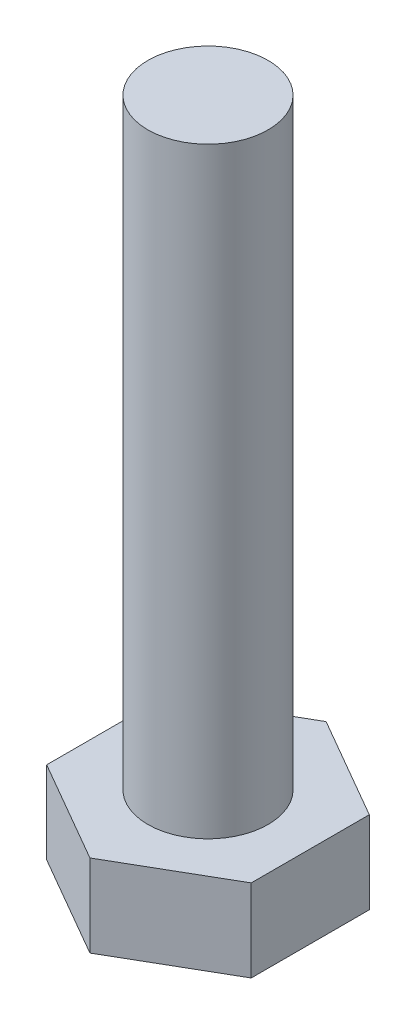
ISO-10303-21;
HEADER;
FILE_DESCRIPTION(('STEP AP214'),'2;1');
FILE_NAME('part.step','',(''),(''),'','','');
FILE_SCHEMA(('AUTOMOTIVE_DESIGN { 1 0 10303 214 1 1 1 1 }'));
ENDSEC;
DATA;
#1=APPLICATION_CONTEXT('core data for automotive mechanical design processes');
#2=APPLICATION_PROTOCOL_DEFINITION('international standard','automotive_design',2000,#1);
#3=PRODUCT_CONTEXT('',#1,'mechanical');
#4=PRODUCT('Part','Part','',(#3));
#5=PRODUCT_RELATED_PRODUCT_CATEGORY('part','',(#4));
#6=PRODUCT_DEFINITION_FORMATION('','',#4);
#7=PRODUCT_DEFINITION_CONTEXT('part definition',#1,'design');
#8=PRODUCT_DEFINITION('design','',#6,#7);
#9=PRODUCT_DEFINITION_SHAPE('','',#8);
#10=(LENGTH_UNIT() NAMED_UNIT(*) SI_UNIT(.MILLI.,.METRE.));
#11=(NAMED_UNIT(*) PLANE_ANGLE_UNIT() SI_UNIT($,.RADIAN.));
#12=(NAMED_UNIT(*) SI_UNIT($,.STERADIAN.) SOLID_ANGLE_UNIT());
#13=UNCERTAINTY_MEASURE_WITH_UNIT(LENGTH_MEASURE(1.E-05),#10,'distance_accuracy_value','');
#14=(GEOMETRIC_REPRESENTATION_CONTEXT(3) GLOBAL_UNCERTAINTY_ASSIGNED_CONTEXT((#13)) GLOBAL_UNIT_ASSIGNED_CONTEXT((#10,
#11,#12)) REPRESENTATION_CONTEXT('',''));
#15=CARTESIAN_POINT('',(0.,0.,0.));
#16=DIRECTION('',(0.,0.,1.));
#17=DIRECTION('',(1.,0.,0.));
#18=AXIS2_PLACEMENT_3D('',#15,#16,#17);
#19=CARTESIAN_POINT('',(0.,8.,0.));
#20=DIRECTION('',(0.,1.,0.));
#21=DIRECTION('',(0.,0.,1.));
#22=AXIS2_PLACEMENT_3D('',#19,#20,#21);
#23=PLANE('',#22);
#24=DIRECTION('',(0.866025403784439,0.,-0.5));
#25=VECTOR('',#24,1.);
#26=CARTESIAN_POINT('',(0.,8.,9.81495457622364));
#27=LINE('',#26,#25);
#28=CARTESIAN_POINT('',(0.,8.,9.81495457622364));
#29=VERTEX_POINT('',#28);
#30=CARTESIAN_POINT('',(8.5,8.,4.90747728811182));
#31=VERTEX_POINT('',#30);
#32=EDGE_CURVE('E119',#29,#31,#27,.T.);
#33=ORIENTED_EDGE('',*,*,#32,.T.);
#34=DIRECTION('',(0.,0.,-1.));
#35=VECTOR('',#34,1.);
#36=CARTESIAN_POINT('',(8.5,8.,4.90747728811182));
#37=LINE('',#36,#35);
#38=CARTESIAN_POINT('',(8.5,8.,-4.90747728811182));
#39=VERTEX_POINT('',#38);
#40=EDGE_CURVE('E108',#31,#39,#37,.T.);
#41=ORIENTED_EDGE('',*,*,#40,.T.);
#42=DIRECTION('',(-0.866025403784439,0.,-0.5));
#43=VECTOR('',#42,1.);
#44=CARTESIAN_POINT('',(8.5,8.,-4.90747728811182));
#45=LINE('',#44,#43);
#46=CARTESIAN_POINT('',(0.,8.,-9.81495457622364));
#47=VERTEX_POINT('',#46);
#48=EDGE_CURVE('E118',#39,#47,#45,.T.);
#49=ORIENTED_EDGE('',*,*,#48,.T.);
#50=DIRECTION('',(-0.866025403784439,0.,0.5));
#51=VECTOR('',#50,1.);
#52=CARTESIAN_POINT('',(0.,8.,-9.81495457622364));
#53=LINE('',#52,#51);
#54=CARTESIAN_POINT('',(-8.5,8.,-4.90747728811182));
#55=VERTEX_POINT('',#54);
#56=EDGE_CURVE('E187',#47,#55,#53,.T.);
#57=ORIENTED_EDGE('',*,*,#56,.T.);
#58=DIRECTION('',(0.,0.,1.));
#59=VECTOR('',#58,1.);
#60=CARTESIAN_POINT('',(-8.5,8.,-4.90747728811182));
#61=LINE('',#60,#59);
#62=CARTESIAN_POINT('',(-8.5,8.,4.90747728811182));
#63=VERTEX_POINT('',#62);
#64=EDGE_CURVE('E189',#55,#63,#61,.T.);
#65=ORIENTED_EDGE('',*,*,#64,.T.);
#66=DIRECTION('',(0.866025403784438,0.,0.5));
#67=VECTOR('',#66,1.);
#68=CARTESIAN_POINT('',(-8.5,8.,4.90747728811182));
#69=LINE('',#68,#67);
#70=EDGE_CURVE('E124',#63,#29,#69,.T.);
#71=ORIENTED_EDGE('',*,*,#70,.T.);
#72=EDGE_LOOP('',(#33,#41,#49,#57,#65,#71));
#73=FACE_BOUND('',#72,.T.);
#74=CARTESIAN_POINT('',(0.,8.,0.));
#75=DIRECTION('',(0.,1.,0.));
#76=DIRECTION('',(0.,0.,1.));
#77=AXIS2_PLACEMENT_3D('',#74,#75,#76);
#78=CIRCLE('',#77,5.);
#79=CARTESIAN_POINT('',(0.,8.,5.));
#80=VERTEX_POINT('',#79);
#81=EDGE_CURVE('E175',#80,#80,#78,.T.);
#82=ORIENTED_EDGE('',*,*,#81,.F.);
#83=EDGE_LOOP('',(#82));
#84=FACE_BOUND('',#83,.T.);
#85=ADVANCED_FACE('F35',(#73,#84),#23,.T.);
#86=CARTESIAN_POINT('',(0.,8.,9.81495457622364));
#87=DIRECTION('',(-0.5,0.,-0.866025403784439));
#88=DIRECTION('',(-0.866025403784439,0.,0.5));
#89=AXIS2_PLACEMENT_3D('',#86,#87,#88);
#90=PLANE('',#89);
#91=DIRECTION('',(0.,-1.,0.));
#92=VECTOR('',#91,1.);
#93=CARTESIAN_POINT('',(0.,8.,9.81495457622364));
#94=LINE('',#93,#92);
#95=CARTESIAN_POINT('',(0.,1.15470053837925,9.81495457622364));
#96=VERTEX_POINT('',#95);
#97=EDGE_CURVE('E192',#29,#96,#94,.T.);
#98=ORIENTED_EDGE('',*,*,#97,.T.);
#99=DIRECTION('',(0.866025403784439,0.,-0.5));
#100=VECTOR('',#99,1.);
#101=CARTESIAN_POINT('',(0.,1.15470053837925,9.81495457622364));
#102=LINE('',#101,#100);
#103=CARTESIAN_POINT('',(8.5,1.15470053837925,4.90747728811182));
#104=VERTEX_POINT('',#103);
#105=EDGE_CURVE('E132',#96,#104,#102,.T.);
#106=ORIENTED_EDGE('',*,*,#105,.T.);
#107=DIRECTION('',(0.,-1.,0.));
#108=VECTOR('',#107,1.);
#109=CARTESIAN_POINT('',(8.5,8.,4.90747728811182));
#110=LINE('',#109,#108);
#111=EDGE_CURVE('E112',#31,#104,#110,.T.);
#112=ORIENTED_EDGE('',*,*,#111,.F.);
#113=ORIENTED_EDGE('',*,*,#32,.F.);
#114=EDGE_LOOP('',(#98,#106,#112,#113));
#115=FACE_BOUND('',#114,.T.);
#116=ADVANCED_FACE('F130',(#115),#90,.F.);
#117=CARTESIAN_POINT('',(8.5,8.,4.90747728811182));
#118=DIRECTION('',(-1.,0.,0.));
#119=DIRECTION('',(0.,0.,1.));
#120=AXIS2_PLACEMENT_3D('',#117,#118,#119);
#121=PLANE('',#120);
#122=ORIENTED_EDGE('',*,*,#111,.T.);
#123=DIRECTION('',(0.,0.,-1.));
#124=VECTOR('',#123,1.);
#125=CARTESIAN_POINT('',(8.5,1.15470053837925,4.90747728811182));
#126=LINE('',#125,#124);
#127=CARTESIAN_POINT('',(8.5,1.15470053837925,-4.90747728811182));
#128=VERTEX_POINT('',#127);
#129=EDGE_CURVE('E154',#104,#128,#126,.T.);
#130=ORIENTED_EDGE('',*,*,#129,.T.);
#131=DIRECTION('',(0.,-1.,0.));
#132=VECTOR('',#131,1.);
#133=CARTESIAN_POINT('',(8.5,8.,-4.90747728811182));
#134=LINE('',#133,#132);
#135=EDGE_CURVE('E115',#39,#128,#134,.T.);
#136=ORIENTED_EDGE('',*,*,#135,.F.);
#137=ORIENTED_EDGE('',*,*,#40,.F.);
#138=EDGE_LOOP('',(#122,#130,#136,#137));
#139=FACE_BOUND('',#138,.T.);
#140=ADVANCED_FACE('F110',(#139),#121,.F.);
#141=CARTESIAN_POINT('',(8.5,8.,-4.90747728811182));
#142=DIRECTION('',(-0.5,0.,0.866025403784439));
#143=DIRECTION('',(0.866025403784439,0.,0.5));
#144=AXIS2_PLACEMENT_3D('',#141,#142,#143);
#145=PLANE('',#144);
#146=ORIENTED_EDGE('',*,*,#135,.T.);
#147=DIRECTION('',(-0.866025403784439,0.,-0.5));
#148=VECTOR('',#147,1.);
#149=CARTESIAN_POINT('',(8.5,1.15470053837925,-4.90747728811182));
#150=LINE('',#149,#148);
#151=CARTESIAN_POINT('',(0.,1.15470053837925,-9.81495457622364));
#152=VERTEX_POINT('',#151);
#153=EDGE_CURVE('E133',#128,#152,#150,.T.);
#154=ORIENTED_EDGE('',*,*,#153,.T.);
#155=DIRECTION('',(0.,-1.,0.));
#156=VECTOR('',#155,1.);
#157=CARTESIAN_POINT('',(0.,8.,-9.81495457622364));
#158=LINE('',#157,#156);
#159=EDGE_CURVE('E138',#47,#152,#158,.T.);
#160=ORIENTED_EDGE('',*,*,#159,.F.);
#161=ORIENTED_EDGE('',*,*,#48,.F.);
#162=EDGE_LOOP('',(#146,#154,#160,#161));
#163=FACE_BOUND('',#162,.T.);
#164=ADVANCED_FACE('F201',(#163),#145,.F.);
#165=CARTESIAN_POINT('',(0.,8.,-9.81495457622364));
#166=DIRECTION('',(0.5,0.,0.866025403784439));
#167=DIRECTION('',(0.866025403784439,0.,-0.5));
#168=AXIS2_PLACEMENT_3D('',#165,#166,#167);
#169=PLANE('',#168);
#170=ORIENTED_EDGE('',*,*,#159,.T.);
#171=DIRECTION('',(-0.866025403784439,0.,0.5));
#172=VECTOR('',#171,1.);
#173=CARTESIAN_POINT('',(0.,1.15470053837925,-9.81495457622364));
#174=LINE('',#173,#172);
#175=CARTESIAN_POINT('',(-8.5,1.15470053837925,-4.90747728811182));
#176=VERTEX_POINT('',#175);
#177=EDGE_CURVE('E11',#152,#176,#174,.T.);
#178=ORIENTED_EDGE('',*,*,#177,.T.);
#179=DIRECTION('',(0.,-1.,0.));
#180=VECTOR('',#179,1.);
#181=CARTESIAN_POINT('',(-8.5,8.,-4.90747728811182));
#182=LINE('',#181,#180);
#183=EDGE_CURVE('E196',#55,#176,#182,.T.);
#184=ORIENTED_EDGE('',*,*,#183,.F.);
#185=ORIENTED_EDGE('',*,*,#56,.F.);
#186=EDGE_LOOP('',(#170,#178,#184,#185));
#187=FACE_BOUND('',#186,.T.);
#188=ADVANCED_FACE('F199',(#187),#169,.F.);
#189=CARTESIAN_POINT('',(-8.5,8.,-4.90747728811182));
#190=DIRECTION('',(1.,0.,0.));
#191=DIRECTION('',(0.,0.,-1.));
#192=AXIS2_PLACEMENT_3D('',#189,#190,#191);
#193=PLANE('',#192);
#194=ORIENTED_EDGE('',*,*,#183,.T.);
#195=DIRECTION('',(0.,0.,1.));
#196=VECTOR('',#195,1.);
#197=CARTESIAN_POINT('',(-8.5,1.15470053837925,-4.90747728811182));
#198=LINE('',#197,#196);
#199=CARTESIAN_POINT('',(-8.5,1.15470053837925,4.90747728811182));
#200=VERTEX_POINT('',#199);
#201=EDGE_CURVE('E44',#176,#200,#198,.T.);
#202=ORIENTED_EDGE('',*,*,#201,.T.);
#203=DIRECTION('',(0.,-1.,0.));
#204=VECTOR('',#203,1.);
#205=CARTESIAN_POINT('',(-8.5,8.,4.90747728811182));
#206=LINE('',#205,#204);
#207=EDGE_CURVE('E194',#63,#200,#206,.T.);
#208=ORIENTED_EDGE('',*,*,#207,.F.);
#209=ORIENTED_EDGE('',*,*,#64,.F.);
#210=EDGE_LOOP('',(#194,#202,#208,#209));
#211=FACE_BOUND('',#210,.T.);
#212=ADVANCED_FACE('F222',(#211),#193,.F.);
#213=CARTESIAN_POINT('',(-8.5,8.,4.90747728811182));
#214=DIRECTION('',(0.5,0.,-0.866025403784438));
#215=DIRECTION('',(-0.866025403784438,0.,-0.5));
#216=AXIS2_PLACEMENT_3D('',#213,#214,#215);
#217=PLANE('',#216);
#218=ORIENTED_EDGE('',*,*,#207,.T.);
#219=DIRECTION('',(0.866025403784438,0.,0.5));
#220=VECTOR('',#219,1.);
#221=CARTESIAN_POINT('',(-8.5,1.15470053837925,4.90747728811182));
#222=LINE('',#221,#220);
#223=EDGE_CURVE('E157',#200,#96,#222,.T.);
#224=ORIENTED_EDGE('',*,*,#223,.T.);
#225=ORIENTED_EDGE('',*,*,#97,.F.);
#226=ORIENTED_EDGE('',*,*,#70,.F.);
#227=EDGE_LOOP('',(#218,#224,#225,#226));
#228=FACE_BOUND('',#227,.T.);
#229=ADVANCED_FACE('F220',(#228),#217,.F.);
#230=CARTESIAN_POINT('',(0.,0.,0.));
#231=DIRECTION('',(0.,1.,0.));
#232=DIRECTION('',(0.,0.,1.));
#233=AXIS2_PLACEMENT_3D('',#230,#231,#232);
#234=PLANE('',#233);
#235=DIRECTION('',(0.866025403784439,0.,-0.5));
#236=VECTOR('',#235,1.);
#237=CARTESIAN_POINT('',(-3.24999999999999,0.,-5.62916512459884));
#238=LINE('',#237,#236);
#239=CARTESIAN_POINT('',(-6.49999999999998,0.,-3.75277674973256));
#240=VERTEX_POINT('',#239);
#241=CARTESIAN_POINT('',(0.,0.,-7.50555349946512));
#242=VERTEX_POINT('',#241);
#243=EDGE_CURVE('E136',#240,#242,#238,.T.);
#244=ORIENTED_EDGE('',*,*,#243,.T.);
#245=DIRECTION('',(0.866025403784439,0.,0.5));
#246=VECTOR('',#245,1.);
#247=CARTESIAN_POINT('',(3.25,0.,-5.62916512459884));
#248=LINE('',#247,#246);
#249=CARTESIAN_POINT('',(6.49999999999998,0.,-3.75277674973256));
#250=VERTEX_POINT('',#249);
#251=EDGE_CURVE('E151',#242,#250,#248,.T.);
#252=ORIENTED_EDGE('',*,*,#251,.T.);
#253=DIRECTION('',(0.,0.,1.));
#254=VECTOR('',#253,1.);
#255=CARTESIAN_POINT('',(6.49999999999998,0.,0.));
#256=LINE('',#255,#254);
#257=CARTESIAN_POINT('',(6.49999999999998,0.,3.75277674973256));
#258=VERTEX_POINT('',#257);
#259=EDGE_CURVE('E149',#250,#258,#256,.T.);
#260=ORIENTED_EDGE('',*,*,#259,.T.);
#261=DIRECTION('',(-0.866025403784439,0.,0.5));
#262=VECTOR('',#261,1.);
#263=CARTESIAN_POINT('',(3.24999999999999,0.,5.62916512459884));
#264=LINE('',#263,#262);
#265=CARTESIAN_POINT('',(0.,0.,7.50555349946512));
#266=VERTEX_POINT('',#265);
#267=EDGE_CURVE('E147',#258,#266,#264,.T.);
#268=ORIENTED_EDGE('',*,*,#267,.T.);
#269=DIRECTION('',(-0.866025403784439,0.,-0.5));
#270=VECTOR('',#269,1.);
#271=CARTESIAN_POINT('',(-3.24999999999999,0.,5.62916512459884));
#272=LINE('',#271,#270);
#273=CARTESIAN_POINT('',(-6.49999999999998,0.,3.75277674973256));
#274=VERTEX_POINT('',#273);
#275=EDGE_CURVE('E145',#266,#274,#272,.T.);
#276=ORIENTED_EDGE('',*,*,#275,.T.);
#277=DIRECTION('',(0.,0.,-1.));
#278=VECTOR('',#277,1.);
#279=CARTESIAN_POINT('',(-6.49999999999998,0.,0.));
#280=LINE('',#279,#278);
#281=EDGE_CURVE('E143',#274,#240,#280,.T.);
#282=ORIENTED_EDGE('',*,*,#281,.T.);
#283=EDGE_LOOP('',(#244,#252,#260,#268,#276,#282));
#284=FACE_BOUND('',#283,.T.);
#285=ADVANCED_FACE('F215',(#284),#234,.F.);
#286=CARTESIAN_POINT('',(0.,58.,0.));
#287=DIRECTION('',(0.,-1.,0.));
#288=DIRECTION('',(0.,0.,-1.));
#289=AXIS2_PLACEMENT_3D('',#286,#287,#288);
#290=CYLINDRICAL_SURFACE('',#289,5.);
#291=CARTESIAN_POINT('',(0.,58.,0.));
#292=DIRECTION('',(0.,1.,0.));
#293=DIRECTION('',(0.,0.,1.));
#294=AXIS2_PLACEMENT_3D('',#291,#292,#293);
#295=CIRCLE('',#294,5.);
#296=CARTESIAN_POINT('',(0.,58.,5.));
#297=VERTEX_POINT('',#296);
#298=EDGE_CURVE('E128',#297,#297,#295,.T.);
#299=ORIENTED_EDGE('',*,*,#298,.F.);
#300=EDGE_LOOP('',(#299));
#301=FACE_BOUND('',#300,.T.);
#302=ORIENTED_EDGE('',*,*,#81,.T.);
#303=EDGE_LOOP('',(#302));
#304=FACE_BOUND('',#303,.T.);
#305=ADVANCED_FACE('F239',(#301,#304),#290,.T.);
#306=CARTESIAN_POINT('',(0.,58.,0.));
#307=DIRECTION('',(0.,1.,0.));
#308=DIRECTION('',(0.,0.,1.));
#309=AXIS2_PLACEMENT_3D('',#306,#307,#308);
#310=PLANE('',#309);
#311=ORIENTED_EDGE('',*,*,#298,.T.);
#312=EDGE_LOOP('',(#311));
#313=FACE_BOUND('',#312,.T.);
#314=ADVANCED_FACE('F245',(#313),#310,.T.);
#315=CARTESIAN_POINT('',(-8.5,1.15470053837925,4.90747728811182));
#316=DIRECTION('',(0.249999999999999,0.86602540378444,-0.433012701892217));
#317=DIRECTION('',(0.866025403784438,0.,0.5));
#318=AXIS2_PLACEMENT_3D('',#315,#316,#317);
#319=PLANE('',#318);
#320=DIRECTION('',(-0.774596669241485,0.447213595499955,0.447213595499958));
#321=VECTOR('',#320,1.);
#322=CARTESIAN_POINT('',(-5.09999999999999,-0.808290376865466,2.94448637286709));
#323=LINE('',#322,#321);
#324=EDGE_CURVE('E169',#274,#200,#323,.T.);
#325=ORIENTED_EDGE('',*,*,#324,.F.);
#326=ORIENTED_EDGE('',*,*,#275,.F.);
#327=DIRECTION('',(0.,0.447213595499955,0.894427190999917));
#328=VECTOR('',#327,1.);
#329=CARTESIAN_POINT('',(0.,-0.808290376865464,5.88897274573417));
#330=LINE('',#329,#328);
#331=EDGE_CURVE('E39',#96,#266,#330,.F.);
#332=ORIENTED_EDGE('',*,*,#331,.F.);
#333=ORIENTED_EDGE('',*,*,#223,.F.);
#334=EDGE_LOOP('',(#325,#326,#332,#333));
#335=FACE_BOUND('',#334,.T.);
#336=ADVANCED_FACE('F37',(#335),#319,.F.);
#337=CARTESIAN_POINT('',(0.,1.15470053837925,9.81495457622364));
#338=DIRECTION('',(-0.249999999999998,0.86602540378444,-0.433012701892217));
#339=DIRECTION('',(0.866025403784439,0.,-0.5));
#340=AXIS2_PLACEMENT_3D('',#337,#338,#339);
#341=PLANE('',#340);
#342=ORIENTED_EDGE('',*,*,#331,.T.);
#343=ORIENTED_EDGE('',*,*,#267,.F.);
#344=DIRECTION('',(0.774596669241485,0.447213595499955,0.447213595499959));
#345=VECTOR('',#344,1.);
#346=CARTESIAN_POINT('',(5.09999999999998,-0.808290376865468,2.94448637286709));
#347=LINE('',#346,#345);
#348=EDGE_CURVE('E167',#104,#258,#347,.F.);
#349=ORIENTED_EDGE('',*,*,#348,.F.);
#350=ORIENTED_EDGE('',*,*,#105,.F.);
#351=EDGE_LOOP('',(#342,#343,#349,#350));
#352=FACE_BOUND('',#351,.T.);
#353=ADVANCED_FACE('F255',(#352),#341,.F.);
#354=CARTESIAN_POINT('',(-8.5,1.15470053837925,-4.90747728811182));
#355=DIRECTION('',(0.499999999999997,0.86602540378444,0.));
#356=DIRECTION('',(0.,0.,1.));
#357=AXIS2_PLACEMENT_3D('',#354,#355,#356);
#358=PLANE('',#357);
#359=ORIENTED_EDGE('',*,*,#324,.T.);
#360=ORIENTED_EDGE('',*,*,#201,.F.);
#361=DIRECTION('',(-0.774596669241485,0.447213595499955,-0.447213595499959));
#362=VECTOR('',#361,1.);
#363=CARTESIAN_POINT('',(-5.09999999999999,-0.808290376865467,-2.94448637286709));
#364=LINE('',#363,#362);
#365=EDGE_CURVE('E164',#240,#176,#364,.T.);
#366=ORIENTED_EDGE('',*,*,#365,.F.);
#367=ORIENTED_EDGE('',*,*,#281,.F.);
#368=EDGE_LOOP('',(#359,#360,#366,#367));
#369=FACE_BOUND('',#368,.T.);
#370=ADVANCED_FACE('F213',(#369),#358,.F.);
#371=CARTESIAN_POINT('',(8.5,1.15470053837925,4.90747728811182));
#372=DIRECTION('',(-0.499999999999997,0.86602540378444,0.));
#373=DIRECTION('',(0.,0.,-1.));
#374=AXIS2_PLACEMENT_3D('',#371,#372,#373);
#375=PLANE('',#374);
#376=ORIENTED_EDGE('',*,*,#348,.T.);
#377=ORIENTED_EDGE('',*,*,#259,.F.);
#378=DIRECTION('',(0.774596669241485,0.447213595499955,-0.447213595499958));
#379=VECTOR('',#378,1.);
#380=CARTESIAN_POINT('',(5.09999999999999,-0.808290376865467,-2.94448637286709));
#381=LINE('',#380,#379);
#382=EDGE_CURVE('E162',#128,#250,#381,.F.);
#383=ORIENTED_EDGE('',*,*,#382,.F.);
#384=ORIENTED_EDGE('',*,*,#129,.F.);
#385=EDGE_LOOP('',(#376,#377,#383,#384));
#386=FACE_BOUND('',#385,.T.);
#387=ADVANCED_FACE('F262',(#386),#375,.F.);
#388=CARTESIAN_POINT('',(0.,1.15470053837925,-9.81495457622364));
#389=DIRECTION('',(0.249999999999998,0.86602540378444,0.433012701892217));
#390=DIRECTION('',(-0.866025403784439,0.,0.5));
#391=AXIS2_PLACEMENT_3D('',#388,#389,#390);
#392=PLANE('',#391);
#393=ORIENTED_EDGE('',*,*,#365,.T.);
#394=ORIENTED_EDGE('',*,*,#177,.F.);
#395=DIRECTION('',(0.,-0.447213595499955,0.894427190999917));
#396=VECTOR('',#395,1.);
#397=CARTESIAN_POINT('',(0.,1.15470053837925,-9.81495457622364));
#398=LINE('',#397,#396);
#399=EDGE_CURVE('E160',#242,#152,#398,.F.);
#400=ORIENTED_EDGE('',*,*,#399,.F.);
#401=ORIENTED_EDGE('',*,*,#243,.F.);
#402=EDGE_LOOP('',(#393,#394,#400,#401));
#403=FACE_BOUND('',#402,.T.);
#404=ADVANCED_FACE('F211',(#403),#392,.F.);
#405=CARTESIAN_POINT('',(8.5,1.15470053837925,-4.90747728811182));
#406=DIRECTION('',(-0.249999999999999,0.86602540378444,0.433012701892217));
#407=DIRECTION('',(-0.866025403784439,0.,-0.5));
#408=AXIS2_PLACEMENT_3D('',#405,#406,#407);
#409=PLANE('',#408);
#410=ORIENTED_EDGE('',*,*,#382,.T.);
#411=ORIENTED_EDGE('',*,*,#251,.F.);
#412=ORIENTED_EDGE('',*,*,#399,.T.);
#413=ORIENTED_EDGE('',*,*,#153,.F.);
#414=EDGE_LOOP('',(#410,#411,#412,#413));
#415=FACE_BOUND('',#414,.T.);
#416=ADVANCED_FACE('F205',(#415),#409,.F.);
#417=CLOSED_SHELL('',(#85,#116,#140,#164,#188,#212,#229,#285,#305,#314,#336,#353,#370,#387,#404,#416));
#418=MANIFOLD_SOLID_BREP('B2',#417);
#419=ADVANCED_BREP_SHAPE_REPRESENTATION('',(#18,#418),#14);
#420=SHAPE_DEFINITION_REPRESENTATION(#9,#419);
ENDSEC;
END-ISO-10303-21;
